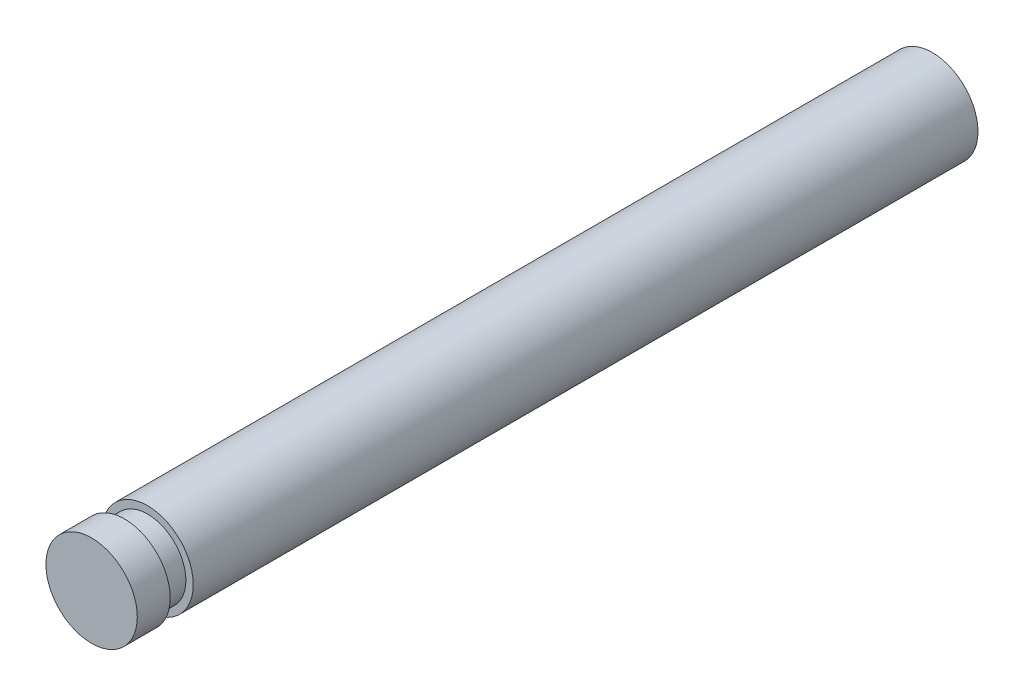
ISO-10303-21;
HEADER;
FILE_DESCRIPTION(('STEP AP214'),'2;1');
FILE_NAME('part.step','',(''),(''),'','','');
FILE_SCHEMA(('AUTOMOTIVE_DESIGN { 1 0 10303 214 1 1 1 1 }'));
ENDSEC;
DATA;
#1=APPLICATION_CONTEXT('core data for automotive mechanical design processes');
#2=APPLICATION_PROTOCOL_DEFINITION('international standard','automotive_design',2000,#1);
#3=PRODUCT_CONTEXT('',#1,'mechanical');
#4=PRODUCT('Part','Part','',(#3));
#5=PRODUCT_RELATED_PRODUCT_CATEGORY('part','',(#4));
#6=PRODUCT_DEFINITION_FORMATION('','',#4);
#7=PRODUCT_DEFINITION_CONTEXT('part definition',#1,'design');
#8=PRODUCT_DEFINITION('design','',#6,#7);
#9=PRODUCT_DEFINITION_SHAPE('','',#8);
#10=(LENGTH_UNIT() NAMED_UNIT(*) SI_UNIT(.MILLI.,.METRE.));
#11=(NAMED_UNIT(*) PLANE_ANGLE_UNIT() SI_UNIT($,.RADIAN.));
#12=(NAMED_UNIT(*) SI_UNIT($,.STERADIAN.) SOLID_ANGLE_UNIT());
#13=UNCERTAINTY_MEASURE_WITH_UNIT(LENGTH_MEASURE(1.E-05),#10,'distance_accuracy_value','');
#14=(GEOMETRIC_REPRESENTATION_CONTEXT(3) GLOBAL_UNCERTAINTY_ASSIGNED_CONTEXT((#13)) GLOBAL_UNIT_ASSIGNED_CONTEXT((#10,
#11,#12)) REPRESENTATION_CONTEXT('',''));
#15=CARTESIAN_POINT('',(0.,0.,0.));
#16=DIRECTION('',(0.,0.,1.));
#17=DIRECTION('',(1.,0.,0.));
#18=AXIS2_PLACEMENT_3D('',#15,#16,#17);
#19=CARTESIAN_POINT('',(0.,0.,-54.5338));
#20=DIRECTION('',(0.,0.,1.));
#21=DIRECTION('',(1.,0.,0.));
#22=AXIS2_PLACEMENT_3D('',#19,#20,#21);
#23=CYLINDRICAL_SURFACE('',#22,3.175);
#24=CARTESIAN_POINT('',(0.,0.,-54.5338));
#25=DIRECTION('',(0.,0.,1.));
#26=DIRECTION('',(1.,0.,0.));
#27=AXIS2_PLACEMENT_3D('',#24,#25,#26);
#28=CIRCLE('',#27,3.175);
#29=CARTESIAN_POINT('',(3.175,0.,-54.5338));
#30=VERTEX_POINT('',#29);
#31=EDGE_CURVE('E40',#30,#30,#28,.T.);
#32=ORIENTED_EDGE('',*,*,#31,.T.);
#33=EDGE_LOOP('',(#32));
#34=FACE_BOUND('',#33,.T.);
#35=CARTESIAN_POINT('',(0.,0.,0.));
#36=DIRECTION('',(0.,0.,1.));
#37=DIRECTION('',(1.,0.,0.));
#38=AXIS2_PLACEMENT_3D('',#35,#36,#37);
#39=CIRCLE('',#38,3.175);
#40=CARTESIAN_POINT('',(3.175,0.,0.));
#41=VERTEX_POINT('',#40);
#42=EDGE_CURVE('E36',#41,#41,#39,.T.);
#43=ORIENTED_EDGE('',*,*,#42,.F.);
#44=EDGE_LOOP('',(#43));
#45=FACE_BOUND('',#44,.T.);
#46=ADVANCED_FACE('F33',(#34,#45),#23,.T.);
#47=CARTESIAN_POINT('',(0.,0.,-54.5338));
#48=DIRECTION('',(0.,0.,1.));
#49=DIRECTION('',(1.,0.,0.));
#50=AXIS2_PLACEMENT_3D('',#47,#48,#49);
#51=PLANE('',#50);
#52=ORIENTED_EDGE('',*,*,#31,.F.);
#53=EDGE_LOOP('',(#52));
#54=FACE_BOUND('',#53,.T.);
#55=ADVANCED_FACE('F74',(#54),#51,.F.);
#56=CARTESIAN_POINT('',(0.,0.,0.));
#57=DIRECTION('',(0.,0.,1.));
#58=DIRECTION('',(1.,0.,0.));
#59=AXIS2_PLACEMENT_3D('',#56,#57,#58);
#60=PLANE('',#59);
#61=CARTESIAN_POINT('',(0.,0.,0.));
#62=DIRECTION('',(0.,0.,1.));
#63=DIRECTION('',(1.,0.,0.));
#64=AXIS2_PLACEMENT_3D('',#61,#62,#63);
#65=CIRCLE('',#64,2.667);
#66=CARTESIAN_POINT('',(2.667,0.,0.));
#67=VERTEX_POINT('',#66);
#68=EDGE_CURVE('E10',#67,#67,#65,.T.);
#69=ORIENTED_EDGE('',*,*,#68,.F.);
#70=EDGE_LOOP('',(#69));
#71=FACE_BOUND('',#70,.T.);
#72=ORIENTED_EDGE('',*,*,#42,.T.);
#73=EDGE_LOOP('',(#72));
#74=FACE_BOUND('',#73,.T.);
#75=ADVANCED_FACE('F79',(#71,#74),#60,.T.);
#76=CARTESIAN_POINT('',(0.,0.,1.6002));
#77=DIRECTION('',(0.,0.,-1.));
#78=DIRECTION('',(-1.,0.,0.));
#79=AXIS2_PLACEMENT_3D('',#76,#77,#78);
#80=CYLINDRICAL_SURFACE('',#79,2.667);
#81=CARTESIAN_POINT('',(0.,0.,1.6002));
#82=DIRECTION('',(0.,0.,1.));
#83=DIRECTION('',(1.,0.,0.));
#84=AXIS2_PLACEMENT_3D('',#81,#82,#83);
#85=CIRCLE('',#84,2.667);
#86=CARTESIAN_POINT('',(2.667,0.,1.6002));
#87=VERTEX_POINT('',#86);
#88=EDGE_CURVE('E46',#87,#87,#85,.T.);
#89=ORIENTED_EDGE('',*,*,#88,.F.);
#90=EDGE_LOOP('',(#89));
#91=FACE_BOUND('',#90,.T.);
#92=ORIENTED_EDGE('',*,*,#68,.T.);
#93=EDGE_LOOP('',(#92));
#94=FACE_BOUND('',#93,.T.);
#95=ADVANCED_FACE('F61',(#91,#94),#80,.T.);
#96=CARTESIAN_POINT('',(0.,0.,3.8862));
#97=DIRECTION('',(0.,0.,-1.));
#98=DIRECTION('',(-1.,0.,0.));
#99=AXIS2_PLACEMENT_3D('',#96,#97,#98);
#100=CYLINDRICAL_SURFACE('',#99,3.175);
#101=CARTESIAN_POINT('',(0.,0.,3.8862));
#102=DIRECTION('',(0.,0.,1.));
#103=DIRECTION('',(1.,0.,0.));
#104=AXIS2_PLACEMENT_3D('',#101,#102,#103);
#105=CIRCLE('',#104,3.175);
#106=CARTESIAN_POINT('',(3.175,0.,3.8862));
#107=VERTEX_POINT('',#106);
#108=EDGE_CURVE('E49',#107,#107,#105,.T.);
#109=ORIENTED_EDGE('',*,*,#108,.F.);
#110=EDGE_LOOP('',(#109));
#111=FACE_BOUND('',#110,.T.);
#112=CARTESIAN_POINT('',(0.,0.,1.6002));
#113=DIRECTION('',(0.,0.,1.));
#114=DIRECTION('',(1.,0.,0.));
#115=AXIS2_PLACEMENT_3D('',#112,#113,#114);
#116=CIRCLE('',#115,3.175);
#117=CARTESIAN_POINT('',(3.175,0.,1.6002));
#118=VERTEX_POINT('',#117);
#119=EDGE_CURVE('E50',#118,#118,#116,.T.);
#120=ORIENTED_EDGE('',*,*,#119,.T.);
#121=EDGE_LOOP('',(#120));
#122=FACE_BOUND('',#121,.T.);
#123=ADVANCED_FACE('F58',(#111,#122),#100,.T.);
#124=CARTESIAN_POINT('',(0.,0.,3.8862));
#125=DIRECTION('',(0.,0.,1.));
#126=DIRECTION('',(1.,0.,0.));
#127=AXIS2_PLACEMENT_3D('',#124,#125,#126);
#128=PLANE('',#127);
#129=ORIENTED_EDGE('',*,*,#108,.T.);
#130=EDGE_LOOP('',(#129));
#131=FACE_BOUND('',#130,.T.);
#132=ADVANCED_FACE('F56',(#131),#128,.T.);
#133=CARTESIAN_POINT('',(0.,0.,1.6002));
#134=DIRECTION('',(0.,0.,1.));
#135=DIRECTION('',(1.,0.,0.));
#136=AXIS2_PLACEMENT_3D('',#133,#134,#135);
#137=PLANE('',#136);
#138=ORIENTED_EDGE('',*,*,#88,.T.);
#139=EDGE_LOOP('',(#138));
#140=FACE_BOUND('',#139,.T.);
#141=ORIENTED_EDGE('',*,*,#119,.F.);
#142=EDGE_LOOP('',(#141));
#143=FACE_BOUND('',#142,.T.);
#144=ADVANCED_FACE('F65',(#140,#143),#137,.F.);
#145=CLOSED_SHELL('',(#46,#55,#75,#95,#123,#132,#144));
#146=MANIFOLD_SOLID_BREP('B2',#145);
#147=ADVANCED_BREP_SHAPE_REPRESENTATION('',(#18,#146),#14);
#148=SHAPE_DEFINITION_REPRESENTATION(#9,#147);
ENDSEC;
END-ISO-10303-21;
